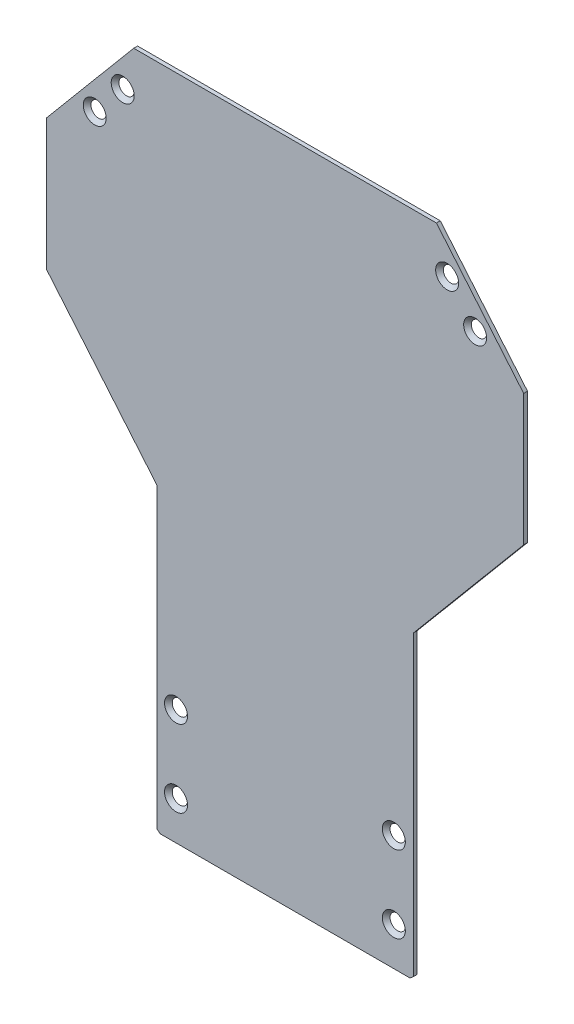
ISO-10303-21;
HEADER;
FILE_DESCRIPTION(('STEP AP214'),'2;1');
FILE_NAME('part.step','',(''),(''),'','','');
FILE_SCHEMA(('AUTOMOTIVE_DESIGN { 1 0 10303 214 1 1 1 1 }'));
ENDSEC;
DATA;
#1=APPLICATION_CONTEXT('core data for automotive mechanical design processes');
#2=APPLICATION_PROTOCOL_DEFINITION('international standard','automotive_design',2000,#1);
#3=PRODUCT_CONTEXT('',#1,'mechanical');
#4=PRODUCT('Part','Part','',(#3));
#5=PRODUCT_RELATED_PRODUCT_CATEGORY('part','',(#4));
#6=PRODUCT_DEFINITION_FORMATION('','',#4);
#7=PRODUCT_DEFINITION_CONTEXT('part definition',#1,'design');
#8=PRODUCT_DEFINITION('design','',#6,#7);
#9=PRODUCT_DEFINITION_SHAPE('','',#8);
#10=(LENGTH_UNIT() NAMED_UNIT(*) SI_UNIT(.MILLI.,.METRE.));
#11=(NAMED_UNIT(*) PLANE_ANGLE_UNIT() SI_UNIT($,.RADIAN.));
#12=(NAMED_UNIT(*) SI_UNIT($,.STERADIAN.) SOLID_ANGLE_UNIT());
#13=UNCERTAINTY_MEASURE_WITH_UNIT(LENGTH_MEASURE(1.E-05),#10,'distance_accuracy_value','');
#14=(GEOMETRIC_REPRESENTATION_CONTEXT(3) GLOBAL_UNCERTAINTY_ASSIGNED_CONTEXT((#13)) GLOBAL_UNIT_ASSIGNED_CONTEXT((#10,
#11,#12)) REPRESENTATION_CONTEXT('',''));
#15=CARTESIAN_POINT('',(0.,0.,0.));
#16=DIRECTION('',(0.,0.,1.));
#17=DIRECTION('',(1.,0.,0.));
#18=AXIS2_PLACEMENT_3D('',#15,#16,#17);
#19=CARTESIAN_POINT('',(0.,0.,0.));
#20=DIRECTION('',(0.,0.,1.));
#21=DIRECTION('',(1.,0.,0.));
#22=AXIS2_PLACEMENT_3D('',#19,#20,#21);
#23=PLANE('',#22);
#24=CARTESIAN_POINT('',(-63.2274186913146,114.399321824908,0.));
#25=DIRECTION('',(0.,0.,1.));
#26=DIRECTION('',(1.,0.,0.));
#27=AXIS2_PLACEMENT_3D('',#24,#25,#26);
#28=CIRCLE('',#27,2.98);
#29=CARTESIAN_POINT('',(-60.2474186913146,114.399321824908,0.));
#30=VERTEX_POINT('',#29);
#31=EDGE_CURVE('E331',#30,#30,#28,.T.);
#32=ORIENTED_EDGE('',*,*,#31,.T.);
#33=EDGE_LOOP('',(#32));
#34=FACE_BOUND('',#33,.T.);
#35=CARTESIAN_POINT('',(63.2274186913146,114.399321824908,0.));
#36=DIRECTION('',(0.,0.,1.));
#37=DIRECTION('',(1.,0.,0.));
#38=AXIS2_PLACEMENT_3D('',#35,#36,#37);
#39=CIRCLE('',#38,2.98);
#40=CARTESIAN_POINT('',(66.2074186913146,114.399321824908,0.));
#41=VERTEX_POINT('',#40);
#42=EDGE_CURVE('E211',#41,#41,#39,.T.);
#43=ORIENTED_EDGE('',*,*,#42,.T.);
#44=EDGE_LOOP('',(#43));
#45=FACE_BOUND('',#44,.T.);
#46=CARTESIAN_POINT('',(42.4444777557757,-84.6006781750925,0.));
#47=DIRECTION('',(0.,0.,1.));
#48=DIRECTION('',(1.,0.,0.));
#49=AXIS2_PLACEMENT_3D('',#46,#47,#48);
#50=CIRCLE('',#49,2.98);
#51=CARTESIAN_POINT('',(45.4244777557757,-84.6006781750925,0.));
#52=VERTEX_POINT('',#51);
#53=EDGE_CURVE('E208',#52,#52,#50,.T.);
#54=ORIENTED_EDGE('',*,*,#53,.T.);
#55=EDGE_LOOP('',(#54));
#56=FACE_BOUND('',#55,.T.);
#57=CARTESIAN_POINT('',(-42.4444777557757,-114.600678175093,0.));
#58=DIRECTION('',(0.,0.,1.));
#59=DIRECTION('',(1.,0.,0.));
#60=AXIS2_PLACEMENT_3D('',#57,#58,#59);
#61=CIRCLE('',#60,2.98);
#62=CARTESIAN_POINT('',(-39.4644777557757,-114.600678175093,0.));
#63=VERTEX_POINT('',#62);
#64=EDGE_CURVE('E237',#63,#63,#61,.T.);
#65=ORIENTED_EDGE('',*,*,#64,.T.);
#66=EDGE_LOOP('',(#65));
#67=FACE_BOUND('',#66,.T.);
#68=DIRECTION('',(0.,1.,0.));
#69=VECTOR('',#68,1.);
#70=CARTESIAN_POINT('',(50.0555222442243,-12.4798743801015,0.));
#71=LINE('',#70,#69);
#72=CARTESIAN_POINT('',(50.0555222442243,-128.492963544423,0.));
#73=VERTEX_POINT('',#72);
#74=CARTESIAN_POINT('',(50.0555222442243,-12.4798743801015,0.));
#75=VERTEX_POINT('',#74);
#76=EDGE_CURVE('E156',#73,#75,#71,.T.);
#77=ORIENTED_EDGE('',*,*,#76,.F.);
#78=DIRECTION('',(0.766044443119012,0.642787609686499,0.));
#79=VECTOR('',#78,1.);
#80=CARTESIAN_POINT('',(50.0555222442243,-128.492963544423,0.));
#81=LINE('',#80,#79);
#82=CARTESIAN_POINT('',(48.735399353555,-129.600678175093,0.));
#83=VERTEX_POINT('',#82);
#84=EDGE_CURVE('E99',#83,#73,#81,.T.);
#85=ORIENTED_EDGE('',*,*,#84,.F.);
#86=DIRECTION('',(1.,0.,0.));
#87=VECTOR('',#86,1.);
#88=CARTESIAN_POINT('',(-48.6243548651066,-129.600678175093,0.));
#89=LINE('',#88,#87);
#90=CARTESIAN_POINT('',(-48.6243548651066,-129.600678175093,0.));
#91=VERTEX_POINT('',#90);
#92=EDGE_CURVE('E93',#91,#83,#89,.T.);
#93=ORIENTED_EDGE('',*,*,#92,.F.);
#94=DIRECTION('',(0.766044443118983,-0.642787609686533,0.));
#95=VECTOR('',#94,1.);
#96=CARTESIAN_POINT('',(-49.9444777557757,-128.492963544423,0.));
#97=LINE('',#96,#95);
#98=CARTESIAN_POINT('',(-49.9444777557757,-128.492963544423,0.));
#99=VERTEX_POINT('',#98);
#100=EDGE_CURVE('E146',#99,#91,#97,.T.);
#101=ORIENTED_EDGE('',*,*,#100,.F.);
#102=DIRECTION('',(0.,-1.,0.));
#103=VECTOR('',#102,1.);
#104=CARTESIAN_POINT('',(-49.9444777557757,-12.4798743801015,0.));
#105=LINE('',#104,#103);
#106=CARTESIAN_POINT('',(-49.9444777557757,-12.4798743801015,0.));
#107=VERTEX_POINT('',#106);
#108=EDGE_CURVE('E174',#107,#99,#105,.T.);
#109=ORIENTED_EDGE('',*,*,#108,.F.);
#110=DIRECTION('',(0.64278760968654,-0.766044443118978,0.));
#111=VECTOR('',#110,1.);
#112=CARTESIAN_POINT('',(-92.9444777557756,38.7655301014493,0.));
#113=LINE('',#112,#111);
#114=CARTESIAN_POINT('',(-92.9444777557756,38.7655301014493,0.));
#115=VERTEX_POINT('',#114);
#116=EDGE_CURVE('E172',#115,#107,#113,.T.);
#117=ORIENTED_EDGE('',*,*,#116,.F.);
#118=DIRECTION('',(0.,-1.,0.));
#119=VECTOR('',#118,1.);
#120=CARTESIAN_POINT('',(-92.9444777557756,89.8739767115243,0.));
#121=LINE('',#120,#119);
#122=CARTESIAN_POINT('',(-92.9444777557756,89.8739767115243,0.));
#123=VERTEX_POINT('',#122);
#124=EDGE_CURVE('E170',#123,#115,#121,.T.);
#125=ORIENTED_EDGE('',*,*,#124,.F.);
#126=DIRECTION('',(-0.642787609686534,-0.766044443118983,0.));
#127=VECTOR('',#126,1.);
#128=CARTESIAN_POINT('',(-58.9396756178042,130.399321824908,0.));
#129=LINE('',#128,#127);
#130=CARTESIAN_POINT('',(-58.9396756178042,130.399321824908,0.));
#131=VERTEX_POINT('',#130);
#132=EDGE_CURVE('E168',#131,#123,#129,.T.);
#133=ORIENTED_EDGE('',*,*,#132,.F.);
#134=DIRECTION('',(-1.,0.,0.));
#135=VECTOR('',#134,1.);
#136=CARTESIAN_POINT('',(59.0507201062527,130.399321824908,0.));
#137=LINE('',#136,#135);
#138=CARTESIAN_POINT('',(59.0507201062527,130.399321824908,0.));
#139=VERTEX_POINT('',#138);
#140=EDGE_CURVE('E166',#139,#131,#137,.T.);
#141=ORIENTED_EDGE('',*,*,#140,.F.);
#142=DIRECTION('',(-0.642787609686534,0.766044443118983,0.));
#143=VECTOR('',#142,1.);
#144=CARTESIAN_POINT('',(59.0507201062527,130.399321824908,0.));
#145=LINE('',#144,#143);
#146=CARTESIAN_POINT('',(93.0555222442241,89.8739767115243,0.));
#147=VERTEX_POINT('',#146);
#148=EDGE_CURVE('E164',#147,#139,#145,.T.);
#149=ORIENTED_EDGE('',*,*,#148,.F.);
#150=DIRECTION('',(0.,1.,0.));
#151=VECTOR('',#150,1.);
#152=CARTESIAN_POINT('',(93.0555222442241,89.8739767115243,0.));
#153=LINE('',#152,#151);
#154=CARTESIAN_POINT('',(93.0555222442241,38.7655301014493,0.));
#155=VERTEX_POINT('',#154);
#156=EDGE_CURVE('E162',#155,#147,#153,.T.);
#157=ORIENTED_EDGE('',*,*,#156,.F.);
#158=DIRECTION('',(0.64278760968654,0.766044443118978,0.));
#159=VECTOR('',#158,1.);
#160=CARTESIAN_POINT('',(93.0555222442241,38.7655301014493,0.));
#161=LINE('',#160,#159);
#162=EDGE_CURVE('E159',#75,#155,#161,.T.);
#163=ORIENTED_EDGE('',*,*,#162,.F.);
#164=EDGE_LOOP('',(#77,#85,#93,#101,#109,#117,#125,#133,#141,#149,#157,#163));
#165=FACE_BOUND('',#164,.T.);
#166=CARTESIAN_POINT('',(-42.4444777557757,-84.6006781750925,0.));
#167=DIRECTION('',(0.,0.,1.));
#168=DIRECTION('',(1.,0.,0.));
#169=AXIS2_PLACEMENT_3D('',#166,#167,#168);
#170=CIRCLE('',#169,2.98);
#171=CARTESIAN_POINT('',(-39.4644777557757,-84.6006781750925,0.));
#172=VERTEX_POINT('',#171);
#173=EDGE_CURVE('E160',#172,#172,#170,.T.);
#174=ORIENTED_EDGE('',*,*,#173,.T.);
#175=EDGE_LOOP('',(#174));
#176=FACE_BOUND('',#175,.T.);
#177=CARTESIAN_POINT('',(42.4444777557757,-114.600678175093,0.));
#178=DIRECTION('',(0.,0.,1.));
#179=DIRECTION('',(1.,0.,0.));
#180=AXIS2_PLACEMENT_3D('',#177,#178,#179);
#181=CIRCLE('',#180,2.98);
#182=CARTESIAN_POINT('',(45.4244777557757,-114.600678175093,0.));
#183=VERTEX_POINT('',#182);
#184=EDGE_CURVE('E203',#183,#183,#181,.T.);
#185=ORIENTED_EDGE('',*,*,#184,.T.);
#186=EDGE_LOOP('',(#185));
#187=FACE_BOUND('',#186,.T.);
#188=CARTESIAN_POINT('',(74.1357138966191,101.399321824908,0.));
#189=DIRECTION('',(0.,0.,1.));
#190=DIRECTION('',(1.,0.,0.));
#191=AXIS2_PLACEMENT_3D('',#188,#189,#190);
#192=CIRCLE('',#191,2.98);
#193=CARTESIAN_POINT('',(77.115713896619,101.399321824908,0.));
#194=VERTEX_POINT('',#193);
#195=EDGE_CURVE('E218',#194,#194,#192,.T.);
#196=ORIENTED_EDGE('',*,*,#195,.T.);
#197=EDGE_LOOP('',(#196));
#198=FACE_BOUND('',#197,.T.);
#199=CARTESIAN_POINT('',(-74.1357138966191,101.399321824908,0.));
#200=DIRECTION('',(0.,0.,1.));
#201=DIRECTION('',(1.,0.,0.));
#202=AXIS2_PLACEMENT_3D('',#199,#200,#201);
#203=CIRCLE('',#202,2.98);
#204=CARTESIAN_POINT('',(-71.155713896619,101.399321824908,0.));
#205=VERTEX_POINT('',#204);
#206=EDGE_CURVE('E37',#205,#205,#203,.T.);
#207=ORIENTED_EDGE('',*,*,#206,.T.);
#208=EDGE_LOOP('',(#207));
#209=FACE_BOUND('',#208,.T.);
#210=ADVANCED_FACE('F33',(#34,#45,#56,#67,#165,#176,#187,#198,#209),#23,.F.);
#211=CARTESIAN_POINT('',(50.0555222442243,-12.4798743801015,1.5));
#212=DIRECTION('',(-1.,0.,0.));
#213=DIRECTION('',(0.,-1.,0.));
#214=AXIS2_PLACEMENT_3D('',#211,#212,#213);
#215=PLANE('',#214);
#216=ORIENTED_EDGE('',*,*,#76,.T.);
#217=DIRECTION('',(0.,0.,-1.));
#218=VECTOR('',#217,1.);
#219=CARTESIAN_POINT('',(50.0555222442243,-12.4798743801015,1.5));
#220=LINE('',#219,#218);
#221=CARTESIAN_POINT('',(50.0555222442243,-12.4798743801015,1.5));
#222=VERTEX_POINT('',#221);
#223=EDGE_CURVE('E11',#222,#75,#220,.T.);
#224=ORIENTED_EDGE('',*,*,#223,.F.);
#225=DIRECTION('',(0.,1.,0.));
#226=VECTOR('',#225,1.);
#227=CARTESIAN_POINT('',(50.0555222442243,-12.4798743801015,1.5));
#228=LINE('',#227,#226);
#229=CARTESIAN_POINT('',(50.0555222442243,-128.492963544423,1.5));
#230=VERTEX_POINT('',#229);
#231=EDGE_CURVE('E179',#230,#222,#228,.T.);
#232=ORIENTED_EDGE('',*,*,#231,.F.);
#233=DIRECTION('',(0.,0.,-1.));
#234=VECTOR('',#233,1.);
#235=CARTESIAN_POINT('',(50.0555222442243,-128.492963544423,1.5));
#236=LINE('',#235,#234);
#237=EDGE_CURVE('E152',#230,#73,#236,.T.);
#238=ORIENTED_EDGE('',*,*,#237,.T.);
#239=EDGE_LOOP('',(#216,#224,#232,#238));
#240=FACE_BOUND('',#239,.T.);
#241=ADVANCED_FACE('F35',(#240),#215,.F.);
#242=CARTESIAN_POINT('',(93.0555222442241,38.7655301014493,1.5));
#243=DIRECTION('',(-0.766044443118978,0.64278760968654,0.));
#244=DIRECTION('',(-0.64278760968654,-0.766044443118978,0.));
#245=AXIS2_PLACEMENT_3D('',#242,#243,#244);
#246=PLANE('',#245);
#247=ORIENTED_EDGE('',*,*,#162,.T.);
#248=DIRECTION('',(0.,0.,-1.));
#249=VECTOR('',#248,1.);
#250=CARTESIAN_POINT('',(93.0555222442241,38.7655301014493,1.5));
#251=LINE('',#250,#249);
#252=CARTESIAN_POINT('',(93.0555222442241,38.7655301014493,1.5));
#253=VERTEX_POINT('',#252);
#254=EDGE_CURVE('E43',#253,#155,#251,.T.);
#255=ORIENTED_EDGE('',*,*,#254,.F.);
#256=DIRECTION('',(0.64278760968654,0.766044443118978,0.));
#257=VECTOR('',#256,1.);
#258=CARTESIAN_POINT('',(93.0555222442241,38.7655301014493,1.5));
#259=LINE('',#258,#257);
#260=EDGE_CURVE('E107',#222,#253,#259,.T.);
#261=ORIENTED_EDGE('',*,*,#260,.F.);
#262=ORIENTED_EDGE('',*,*,#223,.T.);
#263=EDGE_LOOP('',(#247,#255,#261,#262));
#264=FACE_BOUND('',#263,.T.);
#265=ADVANCED_FACE('F292',(#264),#246,.F.);
#266=CARTESIAN_POINT('',(93.0555222442241,89.8739767115243,1.5));
#267=DIRECTION('',(-1.,0.,0.));
#268=DIRECTION('',(0.,-1.,0.));
#269=AXIS2_PLACEMENT_3D('',#266,#267,#268);
#270=PLANE('',#269);
#271=ORIENTED_EDGE('',*,*,#156,.T.);
#272=DIRECTION('',(0.,0.,-1.));
#273=VECTOR('',#272,1.);
#274=CARTESIAN_POINT('',(93.0555222442241,89.8739767115243,1.5));
#275=LINE('',#274,#273);
#276=CARTESIAN_POINT('',(93.0555222442241,89.8739767115243,1.5));
#277=VERTEX_POINT('',#276);
#278=EDGE_CURVE('E198',#277,#147,#275,.T.);
#279=ORIENTED_EDGE('',*,*,#278,.F.);
#280=DIRECTION('',(0.,1.,0.));
#281=VECTOR('',#280,1.);
#282=CARTESIAN_POINT('',(93.0555222442241,89.8739767115243,1.5));
#283=LINE('',#282,#281);
#284=EDGE_CURVE('E247',#253,#277,#283,.T.);
#285=ORIENTED_EDGE('',*,*,#284,.F.);
#286=ORIENTED_EDGE('',*,*,#254,.T.);
#287=EDGE_LOOP('',(#271,#279,#285,#286));
#288=FACE_BOUND('',#287,.T.);
#289=ADVANCED_FACE('F474',(#288),#270,.F.);
#290=CARTESIAN_POINT('',(59.0507201062527,130.399321824908,1.5));
#291=DIRECTION('',(-0.766044443118983,-0.642787609686534,0.));
#292=DIRECTION('',(0.642787609686534,-0.766044443118983,0.));
#293=AXIS2_PLACEMENT_3D('',#290,#291,#292);
#294=PLANE('',#293);
#295=ORIENTED_EDGE('',*,*,#148,.T.);
#296=DIRECTION('',(0.,0.,-1.));
#297=VECTOR('',#296,1.);
#298=CARTESIAN_POINT('',(59.0507201062527,130.399321824908,1.5));
#299=LINE('',#298,#297);
#300=CARTESIAN_POINT('',(59.0507201062527,130.399321824908,1.5));
#301=VERTEX_POINT('',#300);
#302=EDGE_CURVE('E195',#301,#139,#299,.T.);
#303=ORIENTED_EDGE('',*,*,#302,.F.);
#304=DIRECTION('',(-0.642787609686534,0.766044443118983,0.));
#305=VECTOR('',#304,1.);
#306=CARTESIAN_POINT('',(59.0507201062527,130.399321824908,1.5));
#307=LINE('',#306,#305);
#308=EDGE_CURVE('E249',#277,#301,#307,.T.);
#309=ORIENTED_EDGE('',*,*,#308,.F.);
#310=ORIENTED_EDGE('',*,*,#278,.T.);
#311=EDGE_LOOP('',(#295,#303,#309,#310));
#312=FACE_BOUND('',#311,.T.);
#313=ADVANCED_FACE('F464',(#312),#294,.F.);
#314=CARTESIAN_POINT('',(59.0507201062527,130.399321824908,1.5));
#315=DIRECTION('',(0.,-1.,0.));
#316=DIRECTION('',(0.,0.,-1.));
#317=AXIS2_PLACEMENT_3D('',#314,#315,#316);
#318=PLANE('',#317);
#319=ORIENTED_EDGE('',*,*,#140,.T.);
#320=DIRECTION('',(0.,0.,-1.));
#321=VECTOR('',#320,1.);
#322=CARTESIAN_POINT('',(-58.9396756178042,130.399321824908,1.5));
#323=LINE('',#322,#321);
#324=CARTESIAN_POINT('',(-58.9396756178042,130.399321824908,1.5));
#325=VERTEX_POINT('',#324);
#326=EDGE_CURVE('E192',#325,#131,#323,.T.);
#327=ORIENTED_EDGE('',*,*,#326,.F.);
#328=DIRECTION('',(-1.,0.,0.));
#329=VECTOR('',#328,1.);
#330=CARTESIAN_POINT('',(59.0507201062527,130.399321824908,1.5));
#331=LINE('',#330,#329);
#332=EDGE_CURVE('E251',#301,#325,#331,.T.);
#333=ORIENTED_EDGE('',*,*,#332,.F.);
#334=ORIENTED_EDGE('',*,*,#302,.T.);
#335=EDGE_LOOP('',(#319,#327,#333,#334));
#336=FACE_BOUND('',#335,.T.);
#337=ADVANCED_FACE('F454',(#336),#318,.F.);
#338=CARTESIAN_POINT('',(-58.9396756178042,130.399321824908,1.5));
#339=DIRECTION('',(0.766044443118983,-0.642787609686534,0.));
#340=DIRECTION('',(0.642787609686534,0.766044443118983,0.));
#341=AXIS2_PLACEMENT_3D('',#338,#339,#340);
#342=PLANE('',#341);
#343=ORIENTED_EDGE('',*,*,#132,.T.);
#344=DIRECTION('',(0.,0.,-1.));
#345=VECTOR('',#344,1.);
#346=CARTESIAN_POINT('',(-92.9444777557756,89.8739767115243,1.5));
#347=LINE('',#346,#345);
#348=CARTESIAN_POINT('',(-92.9444777557756,89.8739767115243,1.5));
#349=VERTEX_POINT('',#348);
#350=EDGE_CURVE('E189',#349,#123,#347,.T.);
#351=ORIENTED_EDGE('',*,*,#350,.F.);
#352=DIRECTION('',(-0.642787609686534,-0.766044443118983,0.));
#353=VECTOR('',#352,1.);
#354=CARTESIAN_POINT('',(-58.9396756178042,130.399321824908,1.5));
#355=LINE('',#354,#353);
#356=EDGE_CURVE('E253',#325,#349,#355,.T.);
#357=ORIENTED_EDGE('',*,*,#356,.F.);
#358=ORIENTED_EDGE('',*,*,#326,.T.);
#359=EDGE_LOOP('',(#343,#351,#357,#358));
#360=FACE_BOUND('',#359,.T.);
#361=ADVANCED_FACE('F444',(#360),#342,.F.);
#362=CARTESIAN_POINT('',(-92.9444777557756,89.8739767115243,1.5));
#363=DIRECTION('',(1.,0.,0.));
#364=DIRECTION('',(0.,1.,0.));
#365=AXIS2_PLACEMENT_3D('',#362,#363,#364);
#366=PLANE('',#365);
#367=ORIENTED_EDGE('',*,*,#124,.T.);
#368=DIRECTION('',(0.,0.,-1.));
#369=VECTOR('',#368,1.);
#370=CARTESIAN_POINT('',(-92.9444777557756,38.7655301014493,1.5));
#371=LINE('',#370,#369);
#372=CARTESIAN_POINT('',(-92.9444777557756,38.7655301014493,1.5));
#373=VERTEX_POINT('',#372);
#374=EDGE_CURVE('E186',#373,#115,#371,.T.);
#375=ORIENTED_EDGE('',*,*,#374,.F.);
#376=DIRECTION('',(0.,-1.,0.));
#377=VECTOR('',#376,1.);
#378=CARTESIAN_POINT('',(-92.9444777557756,89.8739767115243,1.5));
#379=LINE('',#378,#377);
#380=EDGE_CURVE('E255',#349,#373,#379,.T.);
#381=ORIENTED_EDGE('',*,*,#380,.F.);
#382=ORIENTED_EDGE('',*,*,#350,.T.);
#383=EDGE_LOOP('',(#367,#375,#381,#382));
#384=FACE_BOUND('',#383,.T.);
#385=ADVANCED_FACE('F435',(#384),#366,.F.);
#386=CARTESIAN_POINT('',(-92.9444777557756,38.7655301014493,1.5));
#387=DIRECTION('',(0.766044443118978,0.64278760968654,0.));
#388=DIRECTION('',(-0.64278760968654,0.766044443118978,0.));
#389=AXIS2_PLACEMENT_3D('',#386,#387,#388);
#390=PLANE('',#389);
#391=ORIENTED_EDGE('',*,*,#116,.T.);
#392=DIRECTION('',(0.,0.,-1.));
#393=VECTOR('',#392,1.);
#394=CARTESIAN_POINT('',(-49.9444777557757,-12.4798743801015,1.5));
#395=LINE('',#394,#393);
#396=CARTESIAN_POINT('',(-49.9444777557757,-12.4798743801015,1.5));
#397=VERTEX_POINT('',#396);
#398=EDGE_CURVE('E183',#397,#107,#395,.T.);
#399=ORIENTED_EDGE('',*,*,#398,.F.);
#400=DIRECTION('',(0.64278760968654,-0.766044443118978,0.));
#401=VECTOR('',#400,1.);
#402=CARTESIAN_POINT('',(-92.9444777557756,38.7655301014493,1.5));
#403=LINE('',#402,#401);
#404=EDGE_CURVE('E257',#373,#397,#403,.T.);
#405=ORIENTED_EDGE('',*,*,#404,.F.);
#406=ORIENTED_EDGE('',*,*,#374,.T.);
#407=EDGE_LOOP('',(#391,#399,#405,#406));
#408=FACE_BOUND('',#407,.T.);
#409=ADVANCED_FACE('F263',(#408),#390,.F.);
#410=CARTESIAN_POINT('',(-49.9444777557757,-12.4798743801015,1.5));
#411=DIRECTION('',(1.,0.,0.));
#412=DIRECTION('',(0.,1.,0.));
#413=AXIS2_PLACEMENT_3D('',#410,#411,#412);
#414=PLANE('',#413);
#415=ORIENTED_EDGE('',*,*,#108,.T.);
#416=DIRECTION('',(0.,0.,-1.));
#417=VECTOR('',#416,1.);
#418=CARTESIAN_POINT('',(-49.9444777557757,-128.492963544423,1.5));
#419=LINE('',#418,#417);
#420=CARTESIAN_POINT('',(-49.9444777557757,-128.492963544423,1.5));
#421=VERTEX_POINT('',#420);
#422=EDGE_CURVE('E147',#421,#99,#419,.T.);
#423=ORIENTED_EDGE('',*,*,#422,.F.);
#424=DIRECTION('',(0.,-1.,0.));
#425=VECTOR('',#424,1.);
#426=CARTESIAN_POINT('',(-49.9444777557757,-12.4798743801015,1.5));
#427=LINE('',#426,#425);
#428=EDGE_CURVE('E138',#397,#421,#427,.T.);
#429=ORIENTED_EDGE('',*,*,#428,.F.);
#430=ORIENTED_EDGE('',*,*,#398,.T.);
#431=EDGE_LOOP('',(#415,#423,#429,#430));
#432=FACE_BOUND('',#431,.T.);
#433=ADVANCED_FACE('F267',(#432),#414,.F.);
#434=CARTESIAN_POINT('',(-49.9444777557757,-128.492963544423,1.5));
#435=DIRECTION('',(0.642787609686533,0.766044443118983,0.));
#436=DIRECTION('',(-0.766044443118983,0.642787609686533,0.));
#437=AXIS2_PLACEMENT_3D('',#434,#435,#436);
#438=PLANE('',#437);
#439=ORIENTED_EDGE('',*,*,#100,.T.);
#440=DIRECTION('',(0.,0.,-1.));
#441=VECTOR('',#440,1.);
#442=CARTESIAN_POINT('',(-48.6243548651066,-129.600678175093,1.5));
#443=LINE('',#442,#441);
#444=CARTESIAN_POINT('',(-48.6243548651066,-129.600678175093,1.5));
#445=VERTEX_POINT('',#444);
#446=EDGE_CURVE('E143',#445,#91,#443,.T.);
#447=ORIENTED_EDGE('',*,*,#446,.F.);
#448=DIRECTION('',(0.766044443118983,-0.642787609686533,0.));
#449=VECTOR('',#448,1.);
#450=CARTESIAN_POINT('',(-49.9444777557757,-128.492963544423,1.5));
#451=LINE('',#450,#449);
#452=EDGE_CURVE('E132',#421,#445,#451,.T.);
#453=ORIENTED_EDGE('',*,*,#452,.F.);
#454=ORIENTED_EDGE('',*,*,#422,.T.);
#455=EDGE_LOOP('',(#439,#447,#453,#454));
#456=FACE_BOUND('',#455,.T.);
#457=ADVANCED_FACE('F144',(#456),#438,.F.);
#458=CARTESIAN_POINT('',(-48.6243548651066,-129.600678175093,1.5));
#459=DIRECTION('',(0.,1.,0.));
#460=DIRECTION('',(0.,0.,1.));
#461=AXIS2_PLACEMENT_3D('',#458,#459,#460);
#462=PLANE('',#461);
#463=ORIENTED_EDGE('',*,*,#92,.T.);
#464=DIRECTION('',(0.,0.,-1.));
#465=VECTOR('',#464,1.);
#466=CARTESIAN_POINT('',(48.735399353555,-129.600678175093,1.5));
#467=LINE('',#466,#465);
#468=CARTESIAN_POINT('',(48.735399353555,-129.600678175093,1.5));
#469=VERTEX_POINT('',#468);
#470=EDGE_CURVE('E148',#469,#83,#467,.T.);
#471=ORIENTED_EDGE('',*,*,#470,.F.);
#472=DIRECTION('',(1.,0.,0.));
#473=VECTOR('',#472,1.);
#474=CARTESIAN_POINT('',(-48.6243548651066,-129.600678175093,1.5));
#475=LINE('',#474,#473);
#476=EDGE_CURVE('E136',#445,#469,#475,.T.);
#477=ORIENTED_EDGE('',*,*,#476,.F.);
#478=ORIENTED_EDGE('',*,*,#446,.T.);
#479=EDGE_LOOP('',(#463,#471,#477,#478));
#480=FACE_BOUND('',#479,.T.);
#481=ADVANCED_FACE('F150',(#480),#462,.F.);
#482=CARTESIAN_POINT('',(50.0555222442243,-128.492963544423,1.5));
#483=DIRECTION('',(-0.642787609686499,0.766044443119012,0.));
#484=DIRECTION('',(-0.766044443119012,-0.642787609686499,0.));
#485=AXIS2_PLACEMENT_3D('',#482,#483,#484);
#486=PLANE('',#485);
#487=ORIENTED_EDGE('',*,*,#84,.T.);
#488=ORIENTED_EDGE('',*,*,#237,.F.);
#489=DIRECTION('',(0.766044443119012,0.642787609686499,0.));
#490=VECTOR('',#489,1.);
#491=CARTESIAN_POINT('',(50.0555222442243,-128.492963544423,1.5));
#492=LINE('',#491,#490);
#493=EDGE_CURVE('E52',#469,#230,#492,.T.);
#494=ORIENTED_EDGE('',*,*,#493,.F.);
#495=ORIENTED_EDGE('',*,*,#470,.T.);
#496=EDGE_LOOP('',(#487,#488,#494,#495));
#497=FACE_BOUND('',#496,.T.);
#498=ADVANCED_FACE('F275',(#497),#486,.F.);
#499=CARTESIAN_POINT('',(0.,0.,1.5));
#500=DIRECTION('',(0.,0.,1.));
#501=DIRECTION('',(1.,0.,0.));
#502=AXIS2_PLACEMENT_3D('',#499,#500,#501);
#503=PLANE('',#502);
#504=CARTESIAN_POINT('',(-63.2274186913146,114.399321824908,1.5));
#505=DIRECTION('',(0.,0.,1.));
#506=DIRECTION('',(1.,0.,0.));
#507=AXIS2_PLACEMENT_3D('',#504,#505,#506);
#508=CIRCLE('',#507,4.48);
#509=CARTESIAN_POINT('',(-58.7474186913146,114.399321824908,1.5));
#510=VERTEX_POINT('',#509);
#511=EDGE_CURVE('E329',#510,#510,#508,.T.);
#512=ORIENTED_EDGE('',*,*,#511,.F.);
#513=EDGE_LOOP('',(#512));
#514=FACE_BOUND('',#513,.T.);
#515=CARTESIAN_POINT('',(-74.1357138966191,101.399321824908,1.5));
#516=DIRECTION('',(0.,0.,1.));
#517=DIRECTION('',(1.,0.,0.));
#518=AXIS2_PLACEMENT_3D('',#515,#516,#517);
#519=CIRCLE('',#518,4.48);
#520=CARTESIAN_POINT('',(-69.655713896619,101.399321824908,1.5));
#521=VERTEX_POINT('',#520);
#522=EDGE_CURVE('E225',#521,#521,#519,.T.);
#523=ORIENTED_EDGE('',*,*,#522,.F.);
#524=EDGE_LOOP('',(#523));
#525=FACE_BOUND('',#524,.T.);
#526=CARTESIAN_POINT('',(63.2274186913146,114.399321824908,1.5));
#527=DIRECTION('',(0.,0.,1.));
#528=DIRECTION('',(1.,0.,0.));
#529=AXIS2_PLACEMENT_3D('',#526,#527,#528);
#530=CIRCLE('',#529,4.48);
#531=CARTESIAN_POINT('',(67.7074186913146,114.399321824908,1.5));
#532=VERTEX_POINT('',#531);
#533=EDGE_CURVE('E214',#532,#532,#530,.T.);
#534=ORIENTED_EDGE('',*,*,#533,.F.);
#535=EDGE_LOOP('',(#534));
#536=FACE_BOUND('',#535,.T.);
#537=CARTESIAN_POINT('',(74.1357138966191,101.399321824908,1.5));
#538=DIRECTION('',(0.,0.,1.));
#539=DIRECTION('',(1.,0.,0.));
#540=AXIS2_PLACEMENT_3D('',#537,#538,#539);
#541=CIRCLE('',#540,4.48);
#542=CARTESIAN_POINT('',(78.615713896619,101.399321824908,1.5));
#543=VERTEX_POINT('',#542);
#544=EDGE_CURVE('E213',#543,#543,#541,.T.);
#545=ORIENTED_EDGE('',*,*,#544,.F.);
#546=EDGE_LOOP('',(#545));
#547=FACE_BOUND('',#546,.T.);
#548=CARTESIAN_POINT('',(42.4444777557757,-84.6006781750925,1.5));
#549=DIRECTION('',(0.,0.,1.));
#550=DIRECTION('',(1.,0.,0.));
#551=AXIS2_PLACEMENT_3D('',#548,#549,#550);
#552=CIRCLE('',#551,4.48);
#553=CARTESIAN_POINT('',(46.9244777557757,-84.6006781750925,1.5));
#554=VERTEX_POINT('',#553);
#555=EDGE_CURVE('E210',#554,#554,#552,.T.);
#556=ORIENTED_EDGE('',*,*,#555,.F.);
#557=EDGE_LOOP('',(#556));
#558=FACE_BOUND('',#557,.T.);
#559=CARTESIAN_POINT('',(42.4444777557757,-114.600678175093,1.5));
#560=DIRECTION('',(0.,0.,1.));
#561=DIRECTION('',(1.,0.,0.));
#562=AXIS2_PLACEMENT_3D('',#559,#560,#561);
#563=CIRCLE('',#562,4.48);
#564=CARTESIAN_POINT('',(46.9244777557757,-114.600678175093,1.5));
#565=VERTEX_POINT('',#564);
#566=EDGE_CURVE('E207',#565,#565,#563,.T.);
#567=ORIENTED_EDGE('',*,*,#566,.F.);
#568=EDGE_LOOP('',(#567));
#569=FACE_BOUND('',#568,.T.);
#570=CARTESIAN_POINT('',(-42.4444777557757,-114.600678175093,1.5));
#571=DIRECTION('',(0.,0.,1.));
#572=DIRECTION('',(1.,0.,0.));
#573=AXIS2_PLACEMENT_3D('',#570,#571,#572);
#574=CIRCLE('',#573,4.48);
#575=CARTESIAN_POINT('',(-37.9644777557757,-114.600678175093,1.5));
#576=VERTEX_POINT('',#575);
#577=EDGE_CURVE('E206',#576,#576,#574,.T.);
#578=ORIENTED_EDGE('',*,*,#577,.F.);
#579=EDGE_LOOP('',(#578));
#580=FACE_BOUND('',#579,.T.);
#581=CARTESIAN_POINT('',(-42.4444777557757,-84.6006781750925,1.5));
#582=DIRECTION('',(0.,0.,1.));
#583=DIRECTION('',(1.,0.,0.));
#584=AXIS2_PLACEMENT_3D('',#581,#582,#583);
#585=CIRCLE('',#584,4.48);
#586=CARTESIAN_POINT('',(-37.9644777557757,-84.6006781750925,1.5));
#587=VERTEX_POINT('',#586);
#588=EDGE_CURVE('E240',#587,#587,#585,.T.);
#589=ORIENTED_EDGE('',*,*,#588,.F.);
#590=EDGE_LOOP('',(#589));
#591=FACE_BOUND('',#590,.T.);
#592=ORIENTED_EDGE('',*,*,#231,.T.);
#593=ORIENTED_EDGE('',*,*,#260,.T.);
#594=ORIENTED_EDGE('',*,*,#284,.T.);
#595=ORIENTED_EDGE('',*,*,#308,.T.);
#596=ORIENTED_EDGE('',*,*,#332,.T.);
#597=ORIENTED_EDGE('',*,*,#356,.T.);
#598=ORIENTED_EDGE('',*,*,#380,.T.);
#599=ORIENTED_EDGE('',*,*,#404,.T.);
#600=ORIENTED_EDGE('',*,*,#428,.T.);
#601=ORIENTED_EDGE('',*,*,#452,.T.);
#602=ORIENTED_EDGE('',*,*,#476,.T.);
#603=ORIENTED_EDGE('',*,*,#493,.T.);
#604=EDGE_LOOP('',(#592,#593,#594,#595,#596,#597,#598,#599,#600,#601,#602,#603));
#605=FACE_BOUND('',#604,.T.);
#606=ADVANCED_FACE('F134',(#514,#525,#536,#547,#558,#569,#580,#591,#605),#503,.T.);
#607=CARTESIAN_POINT('',(-42.4444777557757,-84.6006781750925,1.5));
#608=DIRECTION('',(0.,0.,1.));
#609=DIRECTION('',(1.,0.,0.));
#610=AXIS2_PLACEMENT_3D('',#607,#608,#609);
#611=CONICAL_SURFACE('',#610,4.48,0.785398163397447);
#612=ORIENTED_EDGE('',*,*,#588,.T.);
#613=EDGE_LOOP('',(#612));
#614=FACE_BOUND('',#613,.T.);
#615=ORIENTED_EDGE('',*,*,#173,.F.);
#616=EDGE_LOOP('',(#615));
#617=FACE_BOUND('',#616,.T.);
#618=ADVANCED_FACE('F282',(#614,#617),#611,.F.);
#619=CARTESIAN_POINT('',(-42.4444777557757,-114.600678175093,1.5));
#620=DIRECTION('',(0.,0.,1.));
#621=DIRECTION('',(1.,0.,0.));
#622=AXIS2_PLACEMENT_3D('',#619,#620,#621);
#623=CONICAL_SURFACE('',#622,4.48,0.785398163397447);
#624=ORIENTED_EDGE('',*,*,#577,.T.);
#625=EDGE_LOOP('',(#624));
#626=FACE_BOUND('',#625,.T.);
#627=ORIENTED_EDGE('',*,*,#64,.F.);
#628=EDGE_LOOP('',(#627));
#629=FACE_BOUND('',#628,.T.);
#630=ADVANCED_FACE('F297',(#626,#629),#623,.F.);
#631=CARTESIAN_POINT('',(42.4444777557757,-114.600678175093,1.5));
#632=DIRECTION('',(0.,0.,1.));
#633=DIRECTION('',(1.,0.,0.));
#634=AXIS2_PLACEMENT_3D('',#631,#632,#633);
#635=CONICAL_SURFACE('',#634,4.48,0.785398163397447);
#636=ORIENTED_EDGE('',*,*,#566,.T.);
#637=EDGE_LOOP('',(#636));
#638=FACE_BOUND('',#637,.T.);
#639=ORIENTED_EDGE('',*,*,#184,.F.);
#640=EDGE_LOOP('',(#639));
#641=FACE_BOUND('',#640,.T.);
#642=ADVANCED_FACE('F301',(#638,#641),#635,.F.);
#643=CARTESIAN_POINT('',(42.4444777557757,-84.6006781750925,1.5));
#644=DIRECTION('',(0.,0.,1.));
#645=DIRECTION('',(1.,0.,0.));
#646=AXIS2_PLACEMENT_3D('',#643,#644,#645);
#647=CONICAL_SURFACE('',#646,4.48,0.785398163397447);
#648=ORIENTED_EDGE('',*,*,#555,.T.);
#649=EDGE_LOOP('',(#648));
#650=FACE_BOUND('',#649,.T.);
#651=ORIENTED_EDGE('',*,*,#53,.F.);
#652=EDGE_LOOP('',(#651));
#653=FACE_BOUND('',#652,.T.);
#654=ADVANCED_FACE('F305',(#650,#653),#647,.F.);
#655=CARTESIAN_POINT('',(74.1357138966191,101.399321824908,1.5));
#656=DIRECTION('',(0.,0.,1.));
#657=DIRECTION('',(1.,0.,0.));
#658=AXIS2_PLACEMENT_3D('',#655,#656,#657);
#659=CONICAL_SURFACE('',#658,4.48,0.785398163397447);
#660=ORIENTED_EDGE('',*,*,#544,.T.);
#661=EDGE_LOOP('',(#660));
#662=FACE_BOUND('',#661,.T.);
#663=ORIENTED_EDGE('',*,*,#195,.F.);
#664=EDGE_LOOP('',(#663));
#665=FACE_BOUND('',#664,.T.);
#666=ADVANCED_FACE('F309',(#662,#665),#659,.F.);
#667=CARTESIAN_POINT('',(63.2274186913146,114.399321824908,1.5));
#668=DIRECTION('',(0.,0.,1.));
#669=DIRECTION('',(1.,0.,0.));
#670=AXIS2_PLACEMENT_3D('',#667,#668,#669);
#671=CONICAL_SURFACE('',#670,4.48,0.785398163397447);
#672=ORIENTED_EDGE('',*,*,#533,.T.);
#673=EDGE_LOOP('',(#672));
#674=FACE_BOUND('',#673,.T.);
#675=ORIENTED_EDGE('',*,*,#42,.F.);
#676=EDGE_LOOP('',(#675));
#677=FACE_BOUND('',#676,.T.);
#678=ADVANCED_FACE('F313',(#674,#677),#671,.F.);
#679=CARTESIAN_POINT('',(-74.1357138966191,101.399321824908,1.5));
#680=DIRECTION('',(0.,0.,1.));
#681=DIRECTION('',(1.,0.,0.));
#682=AXIS2_PLACEMENT_3D('',#679,#680,#681);
#683=CONICAL_SURFACE('',#682,4.48,0.785398163397447);
#684=ORIENTED_EDGE('',*,*,#522,.T.);
#685=EDGE_LOOP('',(#684));
#686=FACE_BOUND('',#685,.T.);
#687=ORIENTED_EDGE('',*,*,#206,.F.);
#688=EDGE_LOOP('',(#687));
#689=FACE_BOUND('',#688,.T.);
#690=ADVANCED_FACE('F317',(#686,#689),#683,.F.);
#691=CARTESIAN_POINT('',(-63.2274186913146,114.399321824908,1.5));
#692=DIRECTION('',(0.,0.,1.));
#693=DIRECTION('',(1.,0.,0.));
#694=AXIS2_PLACEMENT_3D('',#691,#692,#693);
#695=CONICAL_SURFACE('',#694,4.48,0.785398163397447);
#696=ORIENTED_EDGE('',*,*,#511,.T.);
#697=EDGE_LOOP('',(#696));
#698=FACE_BOUND('',#697,.T.);
#699=ORIENTED_EDGE('',*,*,#31,.F.);
#700=EDGE_LOOP('',(#699));
#701=FACE_BOUND('',#700,.T.);
#702=ADVANCED_FACE('F320',(#698,#701),#695,.F.);
#703=CLOSED_SHELL('',(#210,#241,#265,#289,#313,#337,#361,#385,#409,#433,#457,#481,#498,#606,
#618,#630,#642,#654,#666,#678,#690,#702));
#704=MANIFOLD_SOLID_BREP('B2',#703);
#705=ADVANCED_BREP_SHAPE_REPRESENTATION('',(#18,#704),#14);
#706=SHAPE_DEFINITION_REPRESENTATION(#9,#705);
ENDSEC;
END-ISO-10303-21;
